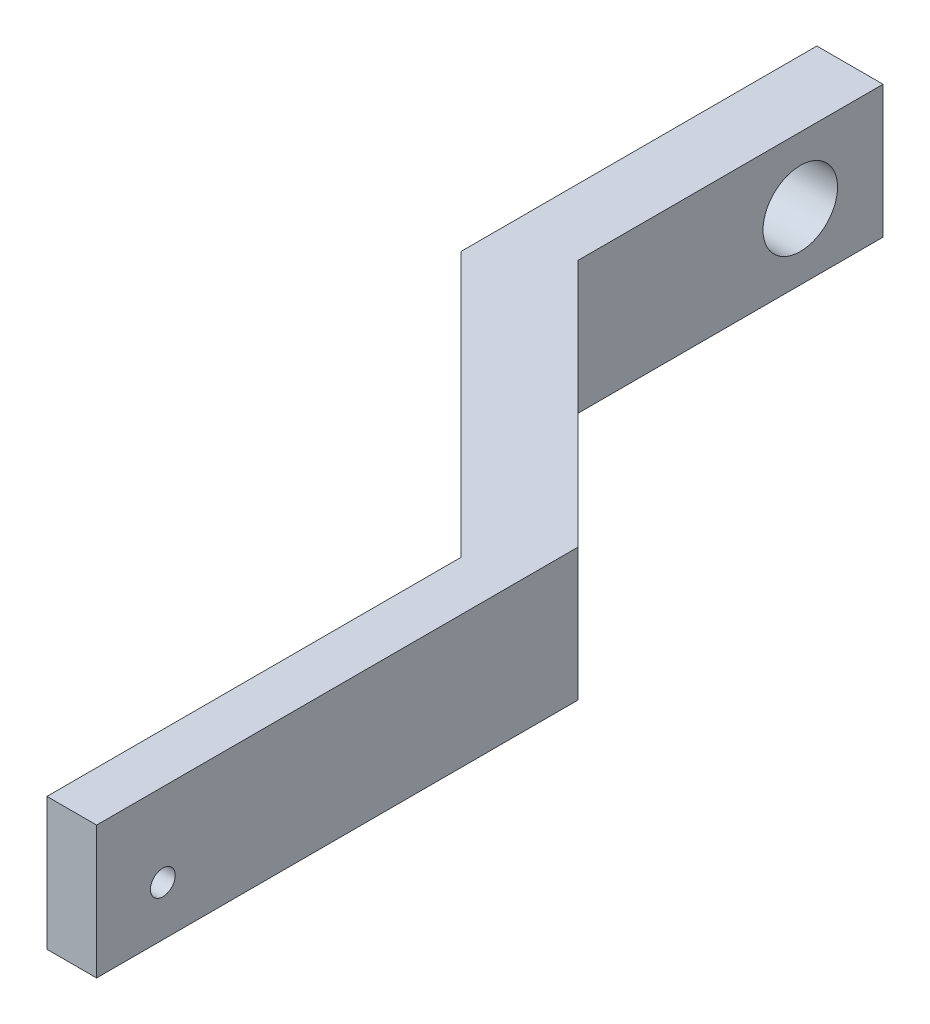
ISO-10303-21;
HEADER;
FILE_DESCRIPTION(('STEP AP214'),'2;1');
FILE_NAME('part.step','',(''),(''),'','','');
FILE_SCHEMA(('AUTOMOTIVE_DESIGN { 1 0 10303 214 1 1 1 1 }'));
ENDSEC;
DATA;
#1=APPLICATION_CONTEXT('core data for automotive mechanical design processes');
#2=APPLICATION_PROTOCOL_DEFINITION('international standard','automotive_design',2000,#1);
#3=PRODUCT_CONTEXT('',#1,'mechanical');
#4=PRODUCT('Part','Part','',(#3));
#5=PRODUCT_RELATED_PRODUCT_CATEGORY('part','',(#4));
#6=PRODUCT_DEFINITION_FORMATION('','',#4);
#7=PRODUCT_DEFINITION_CONTEXT('part definition',#1,'design');
#8=PRODUCT_DEFINITION('design','',#6,#7);
#9=PRODUCT_DEFINITION_SHAPE('','',#8);
#10=(LENGTH_UNIT() NAMED_UNIT(*) SI_UNIT(.MILLI.,.METRE.));
#11=(NAMED_UNIT(*) PLANE_ANGLE_UNIT() SI_UNIT($,.RADIAN.));
#12=(NAMED_UNIT(*) SI_UNIT($,.STERADIAN.) SOLID_ANGLE_UNIT());
#13=UNCERTAINTY_MEASURE_WITH_UNIT(LENGTH_MEASURE(1.E-05),#10,'distance_accuracy_value','');
#14=(GEOMETRIC_REPRESENTATION_CONTEXT(3) GLOBAL_UNCERTAINTY_ASSIGNED_CONTEXT((#13)) GLOBAL_UNIT_ASSIGNED_CONTEXT((#10,
#11,#12)) REPRESENTATION_CONTEXT('',''));
#15=CARTESIAN_POINT('',(0.,0.,0.));
#16=DIRECTION('',(0.,0.,1.));
#17=DIRECTION('',(1.,0.,0.));
#18=AXIS2_PLACEMENT_3D('',#15,#16,#17);
#19=CARTESIAN_POINT('',(0.,8.,-29.0710678118655));
#20=DIRECTION('',(-1.,0.,0.));
#21=DIRECTION('',(0.,0.,1.));
#22=AXIS2_PLACEMENT_3D('',#19,#20,#21);
#23=PLANE('',#22);
#24=CARTESIAN_POINT('',(0.,3.,-3.99999999999997));
#25=DIRECTION('',(1.,0.,0.));
#26=DIRECTION('',(0.,0.,-1.));
#27=AXIS2_PLACEMENT_3D('',#24,#25,#26);
#28=CIRCLE('',#27,0.75);
#29=CARTESIAN_POINT('',(0.,3.,-4.74999999999997));
#30=VERTEX_POINT('',#29);
#31=EDGE_CURVE('E183',#30,#30,#28,.T.);
#32=ORIENTED_EDGE('',*,*,#31,.F.);
#33=EDGE_LOOP('',(#32));
#34=FACE_BOUND('',#33,.T.);
#35=DIRECTION('',(0.,0.,-1.));
#36=VECTOR('',#35,1.);
#37=CARTESIAN_POINT('',(0.,0.,-29.0710678118655));
#38=LINE('',#37,#36);
#39=CARTESIAN_POINT('',(0.,0.,0.));
#40=VERTEX_POINT('',#39);
#41=CARTESIAN_POINT('',(0.,0.,-29.0710678118655));
#42=VERTEX_POINT('',#41);
#43=EDGE_CURVE('E129',#40,#42,#38,.T.);
#44=ORIENTED_EDGE('',*,*,#43,.T.);
#45=DIRECTION('',(0.,-1.,0.));
#46=VECTOR('',#45,1.);
#47=CARTESIAN_POINT('',(0.,8.,-29.0710678118655));
#48=LINE('',#47,#46);
#49=CARTESIAN_POINT('',(0.,8.,-29.0710678118655));
#50=VERTEX_POINT('',#49);
#51=EDGE_CURVE('E11',#50,#42,#48,.T.);
#52=ORIENTED_EDGE('',*,*,#51,.F.);
#53=DIRECTION('',(0.,0.,-1.));
#54=VECTOR('',#53,1.);
#55=CARTESIAN_POINT('',(0.,8.,-29.0710678118655));
#56=LINE('',#55,#54);
#57=CARTESIAN_POINT('',(0.,8.,0.));
#58=VERTEX_POINT('',#57);
#59=EDGE_CURVE('E144',#58,#50,#56,.T.);
#60=ORIENTED_EDGE('',*,*,#59,.F.);
#61=DIRECTION('',(0.,-1.,0.));
#62=VECTOR('',#61,1.);
#63=CARTESIAN_POINT('',(0.,8.,0.));
#64=LINE('',#63,#62);
#65=EDGE_CURVE('E125',#58,#40,#64,.T.);
#66=ORIENTED_EDGE('',*,*,#65,.T.);
#67=EDGE_LOOP('',(#44,#52,#60,#66));
#68=FACE_BOUND('',#67,.T.);
#69=ADVANCED_FACE('F32',(#34,#68),#23,.F.);
#70=CARTESIAN_POINT('',(-15.,8.,-44.0710678118656));
#71=DIRECTION('',(-0.707106781186551,0.,0.707106781186544));
#72=DIRECTION('',(0.707106781186544,0.,0.707106781186551));
#73=AXIS2_PLACEMENT_3D('',#70,#71,#72);
#74=PLANE('',#73);
#75=DIRECTION('',(-0.707106781186544,0.,-0.707106781186551));
#76=VECTOR('',#75,1.);
#77=CARTESIAN_POINT('',(-15.,0.,-44.0710678118656));
#78=LINE('',#77,#76);
#79=CARTESIAN_POINT('',(-15.,0.,-44.0710678118656));
#80=VERTEX_POINT('',#79);
#81=EDGE_CURVE('E132',#42,#80,#78,.T.);
#82=ORIENTED_EDGE('',*,*,#81,.T.);
#83=DIRECTION('',(0.,-1.,0.));
#84=VECTOR('',#83,1.);
#85=CARTESIAN_POINT('',(-15.,8.,-44.0710678118656));
#86=LINE('',#85,#84);
#87=CARTESIAN_POINT('',(-15.,8.,-44.0710678118656));
#88=VERTEX_POINT('',#87);
#89=EDGE_CURVE('E41',#88,#80,#86,.T.);
#90=ORIENTED_EDGE('',*,*,#89,.F.);
#91=DIRECTION('',(-0.707106781186544,0.,-0.707106781186551));
#92=VECTOR('',#91,1.);
#93=CARTESIAN_POINT('',(-15.,8.,-44.0710678118656));
#94=LINE('',#93,#92);
#95=EDGE_CURVE('E92',#50,#88,#94,.T.);
#96=ORIENTED_EDGE('',*,*,#95,.F.);
#97=ORIENTED_EDGE('',*,*,#51,.T.);
#98=EDGE_LOOP('',(#82,#90,#96,#97));
#99=FACE_BOUND('',#98,.T.);
#100=ADVANCED_FACE('F201',(#99),#74,.F.);
#101=CARTESIAN_POINT('',(-15.,8.,-62.5));
#102=DIRECTION('',(-1.,0.,0.));
#103=DIRECTION('',(0.,0.,1.));
#104=AXIS2_PLACEMENT_3D('',#101,#102,#103);
#105=PLANE('',#104);
#106=CARTESIAN_POINT('',(-15.,4.,-57.5));
#107=DIRECTION('',(-1.,0.,0.));
#108=DIRECTION('',(0.,0.,1.));
#109=AXIS2_PLACEMENT_3D('',#106,#107,#108);
#110=CIRCLE('',#109,2.24999999999999);
#111=CARTESIAN_POINT('',(-15.,4.,-55.25));
#112=VERTEX_POINT('',#111);
#113=EDGE_CURVE('E133',#112,#112,#110,.T.);
#114=ORIENTED_EDGE('',*,*,#113,.T.);
#115=EDGE_LOOP('',(#114));
#116=FACE_BOUND('',#115,.T.);
#117=DIRECTION('',(0.,0.,-1.));
#118=VECTOR('',#117,1.);
#119=CARTESIAN_POINT('',(-15.,0.,-62.5));
#120=LINE('',#119,#118);
#121=CARTESIAN_POINT('',(-15.,0.,-62.5));
#122=VERTEX_POINT('',#121);
#123=EDGE_CURVE('E135',#80,#122,#120,.T.);
#124=ORIENTED_EDGE('',*,*,#123,.T.);
#125=DIRECTION('',(0.,-1.,0.));
#126=VECTOR('',#125,1.);
#127=CARTESIAN_POINT('',(-15.,8.,-62.5));
#128=LINE('',#127,#126);
#129=CARTESIAN_POINT('',(-15.,8.,-62.5));
#130=VERTEX_POINT('',#129);
#131=EDGE_CURVE('E151',#130,#122,#128,.T.);
#132=ORIENTED_EDGE('',*,*,#131,.F.);
#133=DIRECTION('',(0.,0.,-1.));
#134=VECTOR('',#133,1.);
#135=CARTESIAN_POINT('',(-15.,8.,-62.5));
#136=LINE('',#135,#134);
#137=EDGE_CURVE('E160',#88,#130,#136,.T.);
#138=ORIENTED_EDGE('',*,*,#137,.F.);
#139=ORIENTED_EDGE('',*,*,#89,.T.);
#140=EDGE_LOOP('',(#124,#132,#138,#139));
#141=FACE_BOUND('',#140,.T.);
#142=ADVANCED_FACE('F158',(#116,#141),#105,.F.);
#143=CARTESIAN_POINT('',(-19.,8.,-62.5));
#144=DIRECTION('',(0.,0.,1.));
#145=DIRECTION('',(1.,0.,0.));
#146=AXIS2_PLACEMENT_3D('',#143,#144,#145);
#147=PLANE('',#146);
#148=DIRECTION('',(-1.,0.,0.));
#149=VECTOR('',#148,1.);
#150=CARTESIAN_POINT('',(-19.,0.,-62.5));
#151=LINE('',#150,#149);
#152=CARTESIAN_POINT('',(-19.,0.,-62.5));
#153=VERTEX_POINT('',#152);
#154=EDGE_CURVE('E137',#122,#153,#151,.T.);
#155=ORIENTED_EDGE('',*,*,#154,.T.);
#156=DIRECTION('',(0.,-1.,0.));
#157=VECTOR('',#156,1.);
#158=CARTESIAN_POINT('',(-19.,8.,-62.5));
#159=LINE('',#158,#157);
#160=CARTESIAN_POINT('',(-19.,8.,-62.5));
#161=VERTEX_POINT('',#160);
#162=EDGE_CURVE('E148',#161,#153,#159,.T.);
#163=ORIENTED_EDGE('',*,*,#162,.F.);
#164=DIRECTION('',(-1.,0.,0.));
#165=VECTOR('',#164,1.);
#166=CARTESIAN_POINT('',(-19.,8.,-62.5));
#167=LINE('',#166,#165);
#168=EDGE_CURVE('E172',#130,#161,#167,.T.);
#169=ORIENTED_EDGE('',*,*,#168,.F.);
#170=ORIENTED_EDGE('',*,*,#131,.T.);
#171=EDGE_LOOP('',(#155,#163,#169,#170));
#172=FACE_BOUND('',#171,.T.);
#173=ADVANCED_FACE('F168',(#172),#147,.F.);
#174=CARTESIAN_POINT('',(-19.,8.,-41.0000000000002));
#175=DIRECTION('',(1.,0.,0.));
#176=DIRECTION('',(0.,0.,-1.));
#177=AXIS2_PLACEMENT_3D('',#174,#175,#176);
#178=PLANE('',#177);
#179=CARTESIAN_POINT('',(-19.,4.,-57.5));
#180=DIRECTION('',(1.,0.,0.));
#181=DIRECTION('',(0.,0.,-1.));
#182=AXIS2_PLACEMENT_3D('',#179,#180,#181);
#183=CIRCLE('',#182,2.24999999999999);
#184=CARTESIAN_POINT('',(-19.,4.,-59.75));
#185=VERTEX_POINT('',#184);
#186=EDGE_CURVE('E180',#185,#185,#183,.T.);
#187=ORIENTED_EDGE('',*,*,#186,.T.);
#188=EDGE_LOOP('',(#187));
#189=FACE_BOUND('',#188,.T.);
#190=DIRECTION('',(0.,0.,1.));
#191=VECTOR('',#190,1.);
#192=CARTESIAN_POINT('',(-19.,0.,-41.0000000000002));
#193=LINE('',#192,#191);
#194=CARTESIAN_POINT('',(-19.,0.,-41.0000000000002));
#195=VERTEX_POINT('',#194);
#196=EDGE_CURVE('E139',#153,#195,#193,.T.);
#197=ORIENTED_EDGE('',*,*,#196,.T.);
#198=DIRECTION('',(0.,-1.,0.));
#199=VECTOR('',#198,1.);
#200=CARTESIAN_POINT('',(-19.,8.,-41.0000000000002));
#201=LINE('',#200,#199);
#202=CARTESIAN_POINT('',(-19.,8.,-41.0000000000002));
#203=VERTEX_POINT('',#202);
#204=EDGE_CURVE('E120',#203,#195,#201,.T.);
#205=ORIENTED_EDGE('',*,*,#204,.F.);
#206=DIRECTION('',(0.,0.,1.));
#207=VECTOR('',#206,1.);
#208=CARTESIAN_POINT('',(-19.,8.,-41.0000000000002));
#209=LINE('',#208,#207);
#210=EDGE_CURVE('E111',#161,#203,#209,.T.);
#211=ORIENTED_EDGE('',*,*,#210,.F.);
#212=ORIENTED_EDGE('',*,*,#162,.T.);
#213=EDGE_LOOP('',(#197,#205,#211,#212));
#214=FACE_BOUND('',#213,.T.);
#215=ADVANCED_FACE('F171',(#189,#214),#178,.F.);
#216=CARTESIAN_POINT('',(-3.,8.,-25.));
#217=DIRECTION('',(0.707106781186551,0.,-0.707106781186544));
#218=DIRECTION('',(-0.707106781186544,0.,-0.707106781186551));
#219=AXIS2_PLACEMENT_3D('',#216,#217,#218);
#220=PLANE('',#219);
#221=DIRECTION('',(0.707106781186544,0.,0.707106781186551));
#222=VECTOR('',#221,1.);
#223=CARTESIAN_POINT('',(-3.,0.,-25.));
#224=LINE('',#223,#222);
#225=CARTESIAN_POINT('',(-3.,0.,-25.));
#226=VERTEX_POINT('',#225);
#227=EDGE_CURVE('E119',#195,#226,#224,.T.);
#228=ORIENTED_EDGE('',*,*,#227,.T.);
#229=DIRECTION('',(0.,-1.,0.));
#230=VECTOR('',#229,1.);
#231=CARTESIAN_POINT('',(-3.,8.,-25.));
#232=LINE('',#231,#230);
#233=CARTESIAN_POINT('',(-3.,8.,-25.));
#234=VERTEX_POINT('',#233);
#235=EDGE_CURVE('E116',#234,#226,#232,.T.);
#236=ORIENTED_EDGE('',*,*,#235,.F.);
#237=DIRECTION('',(0.707106781186544,0.,0.707106781186551));
#238=VECTOR('',#237,1.);
#239=CARTESIAN_POINT('',(-3.,8.,-25.));
#240=LINE('',#239,#238);
#241=EDGE_CURVE('E105',#203,#234,#240,.T.);
#242=ORIENTED_EDGE('',*,*,#241,.F.);
#243=ORIENTED_EDGE('',*,*,#204,.T.);
#244=EDGE_LOOP('',(#228,#236,#242,#243));
#245=FACE_BOUND('',#244,.T.);
#246=ADVANCED_FACE('F117',(#245),#220,.F.);
#247=CARTESIAN_POINT('',(-3.,8.,0.));
#248=DIRECTION('',(1.,0.,0.));
#249=DIRECTION('',(0.,0.,-1.));
#250=AXIS2_PLACEMENT_3D('',#247,#248,#249);
#251=PLANE('',#250);
#252=CARTESIAN_POINT('',(-3.,3.,-3.99999999999997));
#253=DIRECTION('',(1.,0.,0.));
#254=DIRECTION('',(0.,0.,-1.));
#255=AXIS2_PLACEMENT_3D('',#252,#253,#254);
#256=CIRCLE('',#255,0.75);
#257=CARTESIAN_POINT('',(-3.,3.,-4.74999999999997));
#258=VERTEX_POINT('',#257);
#259=EDGE_CURVE('E35',#258,#258,#256,.T.);
#260=ORIENTED_EDGE('',*,*,#259,.T.);
#261=EDGE_LOOP('',(#260));
#262=FACE_BOUND('',#261,.T.);
#263=DIRECTION('',(0.,0.,1.));
#264=VECTOR('',#263,1.);
#265=CARTESIAN_POINT('',(-3.,0.,0.));
#266=LINE('',#265,#264);
#267=CARTESIAN_POINT('',(-3.,0.,0.));
#268=VERTEX_POINT('',#267);
#269=EDGE_CURVE('E78',#226,#268,#266,.T.);
#270=ORIENTED_EDGE('',*,*,#269,.T.);
#271=DIRECTION('',(0.,-1.,0.));
#272=VECTOR('',#271,1.);
#273=CARTESIAN_POINT('',(-3.,8.,0.));
#274=LINE('',#273,#272);
#275=CARTESIAN_POINT('',(-3.,8.,0.));
#276=VERTEX_POINT('',#275);
#277=EDGE_CURVE('E121',#276,#268,#274,.T.);
#278=ORIENTED_EDGE('',*,*,#277,.F.);
#279=DIRECTION('',(0.,0.,1.));
#280=VECTOR('',#279,1.);
#281=CARTESIAN_POINT('',(-3.,8.,0.));
#282=LINE('',#281,#280);
#283=EDGE_CURVE('E109',#234,#276,#282,.T.);
#284=ORIENTED_EDGE('',*,*,#283,.F.);
#285=ORIENTED_EDGE('',*,*,#235,.T.);
#286=EDGE_LOOP('',(#270,#278,#284,#285));
#287=FACE_BOUND('',#286,.T.);
#288=ADVANCED_FACE('F123',(#262,#287),#251,.F.);
#289=CARTESIAN_POINT('',(0.,8.,0.));
#290=DIRECTION('',(0.,0.,-1.));
#291=DIRECTION('',(-1.,0.,0.));
#292=AXIS2_PLACEMENT_3D('',#289,#290,#291);
#293=PLANE('',#292);
#294=DIRECTION('',(1.,0.,0.));
#295=VECTOR('',#294,1.);
#296=CARTESIAN_POINT('',(0.,0.,0.));
#297=LINE('',#296,#295);
#298=EDGE_CURVE('E84',#268,#40,#297,.T.);
#299=ORIENTED_EDGE('',*,*,#298,.T.);
#300=ORIENTED_EDGE('',*,*,#65,.F.);
#301=DIRECTION('',(1.,0.,0.));
#302=VECTOR('',#301,1.);
#303=CARTESIAN_POINT('',(0.,8.,0.));
#304=LINE('',#303,#302);
#305=EDGE_CURVE('E49',#276,#58,#304,.T.);
#306=ORIENTED_EDGE('',*,*,#305,.F.);
#307=ORIENTED_EDGE('',*,*,#277,.T.);
#308=EDGE_LOOP('',(#299,#300,#306,#307));
#309=FACE_BOUND('',#308,.T.);
#310=ADVANCED_FACE('F209',(#309),#293,.F.);
#311=CARTESIAN_POINT('',(0.,8.,0.));
#312=DIRECTION('',(0.,-1.,0.));
#313=DIRECTION('',(0.,0.,-1.));
#314=AXIS2_PLACEMENT_3D('',#311,#312,#313);
#315=PLANE('',#314);
#316=ORIENTED_EDGE('',*,*,#59,.T.);
#317=ORIENTED_EDGE('',*,*,#95,.T.);
#318=ORIENTED_EDGE('',*,*,#137,.T.);
#319=ORIENTED_EDGE('',*,*,#168,.T.);
#320=ORIENTED_EDGE('',*,*,#210,.T.);
#321=ORIENTED_EDGE('',*,*,#241,.T.);
#322=ORIENTED_EDGE('',*,*,#283,.T.);
#323=ORIENTED_EDGE('',*,*,#305,.T.);
#324=EDGE_LOOP('',(#316,#317,#318,#319,#320,#321,#322,#323));
#325=FACE_BOUND('',#324,.T.);
#326=ADVANCED_FACE('F107',(#325),#315,.F.);
#327=CARTESIAN_POINT('',(0.,0.,0.));
#328=DIRECTION('',(0.,-1.,0.));
#329=DIRECTION('',(0.,0.,-1.));
#330=AXIS2_PLACEMENT_3D('',#327,#328,#329);
#331=PLANE('',#330);
#332=ORIENTED_EDGE('',*,*,#43,.F.);
#333=ORIENTED_EDGE('',*,*,#298,.F.);
#334=ORIENTED_EDGE('',*,*,#269,.F.);
#335=ORIENTED_EDGE('',*,*,#227,.F.);
#336=ORIENTED_EDGE('',*,*,#196,.F.);
#337=ORIENTED_EDGE('',*,*,#154,.F.);
#338=ORIENTED_EDGE('',*,*,#123,.F.);
#339=ORIENTED_EDGE('',*,*,#81,.F.);
#340=EDGE_LOOP('',(#332,#333,#334,#335,#336,#337,#338,#339));
#341=FACE_BOUND('',#340,.T.);
#342=ADVANCED_FACE('F164',(#341),#331,.T.);
#343=CARTESIAN_POINT('',(-19.,4.,-57.5));
#344=DIRECTION('',(1.,0.,0.));
#345=DIRECTION('',(0.,0.,-1.));
#346=AXIS2_PLACEMENT_3D('',#343,#344,#345);
#347=CYLINDRICAL_SURFACE('',#346,2.24999999999999);
#348=ORIENTED_EDGE('',*,*,#186,.F.);
#349=EDGE_LOOP('',(#348));
#350=FACE_BOUND('',#349,.T.);
#351=ORIENTED_EDGE('',*,*,#113,.F.);
#352=EDGE_LOOP('',(#351));
#353=FACE_BOUND('',#352,.T.);
#354=ADVANCED_FACE('F193',(#350,#353),#347,.F.);
#355=CARTESIAN_POINT('',(-19.0000000000001,3.,-4.00000000000001));
#356=DIRECTION('',(1.,0.,0.));
#357=DIRECTION('',(0.,0.,-1.));
#358=AXIS2_PLACEMENT_3D('',#355,#356,#357);
#359=CYLINDRICAL_SURFACE('',#358,0.75);
#360=ORIENTED_EDGE('',*,*,#31,.T.);
#361=EDGE_LOOP('',(#360));
#362=FACE_BOUND('',#361,.T.);
#363=ORIENTED_EDGE('',*,*,#259,.F.);
#364=EDGE_LOOP('',(#363));
#365=FACE_BOUND('',#364,.T.);
#366=ADVANCED_FACE('F191',(#362,#365),#359,.F.);
#367=CLOSED_SHELL('',(#69,#100,#142,#173,#215,#246,#288,#310,#326,#342,#354,#366));
#368=MANIFOLD_SOLID_BREP('B2',#367);
#369=ADVANCED_BREP_SHAPE_REPRESENTATION('',(#18,#368),#14);
#370=SHAPE_DEFINITION_REPRESENTATION(#9,#369);
ENDSEC;
END-ISO-10303-21;
